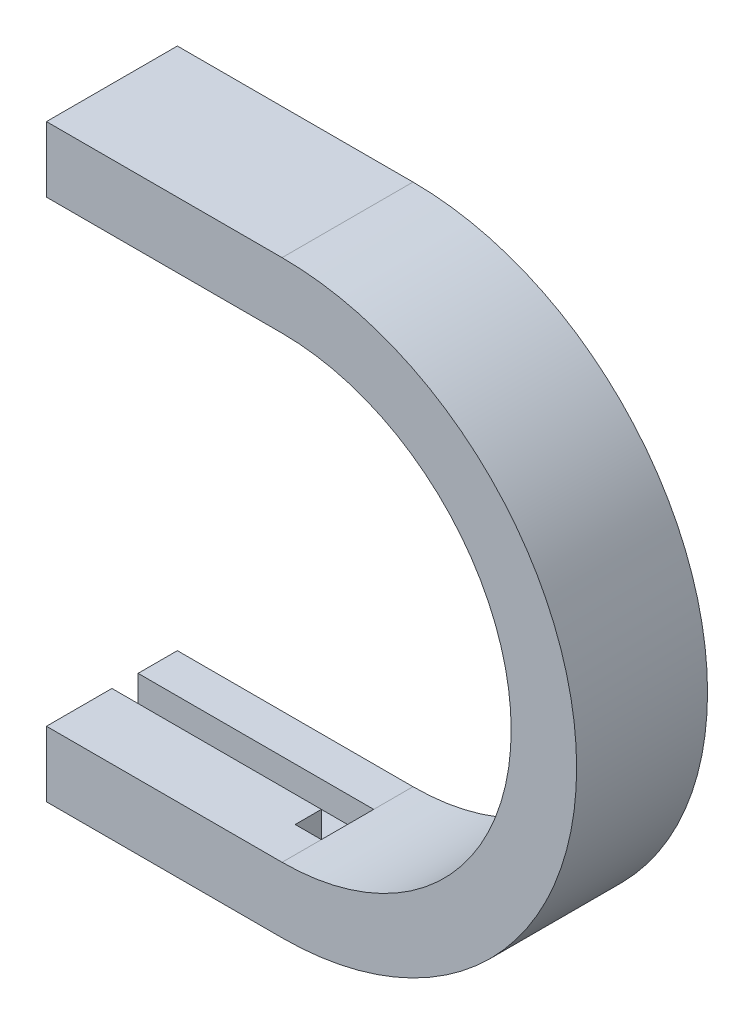
ISO-10303-21;
HEADER;
FILE_DESCRIPTION(('STEP AP214'),'2;1');
FILE_NAME('part.step','',(''),(''),'','','');
FILE_SCHEMA(('AUTOMOTIVE_DESIGN { 1 0 10303 214 1 1 1 1 }'));
ENDSEC;
DATA;
#1=APPLICATION_CONTEXT('core data for automotive mechanical design processes');
#2=APPLICATION_PROTOCOL_DEFINITION('international standard','automotive_design',2000,#1);
#3=PRODUCT_CONTEXT('',#1,'mechanical');
#4=PRODUCT('Part','Part','',(#3));
#5=PRODUCT_RELATED_PRODUCT_CATEGORY('part','',(#4));
#6=PRODUCT_DEFINITION_FORMATION('','',#4);
#7=PRODUCT_DEFINITION_CONTEXT('part definition',#1,'design');
#8=PRODUCT_DEFINITION('design','',#6,#7);
#9=PRODUCT_DEFINITION_SHAPE('','',#8);
#10=(LENGTH_UNIT() NAMED_UNIT(*) SI_UNIT(.MILLI.,.METRE.));
#11=(NAMED_UNIT(*) PLANE_ANGLE_UNIT() SI_UNIT($,.RADIAN.));
#12=(NAMED_UNIT(*) SI_UNIT($,.STERADIAN.) SOLID_ANGLE_UNIT());
#13=UNCERTAINTY_MEASURE_WITH_UNIT(LENGTH_MEASURE(1.E-05),#10,'distance_accuracy_value','');
#14=(GEOMETRIC_REPRESENTATION_CONTEXT(3) GLOBAL_UNCERTAINTY_ASSIGNED_CONTEXT((#13)) GLOBAL_UNIT_ASSIGNED_CONTEXT((#10,
#11,#12)) REPRESENTATION_CONTEXT('',''));
#15=CARTESIAN_POINT('',(0.,0.,0.));
#16=DIRECTION('',(0.,0.,1.));
#17=DIRECTION('',(1.,0.,0.));
#18=AXIS2_PLACEMENT_3D('',#15,#16,#17);
#19=CARTESIAN_POINT('',(-22.5,-1.25,-75.));
#20=DIRECTION('',(0.,-1.,0.));
#21=DIRECTION('',(-1.,0.,0.));
#22=AXIS2_PLACEMENT_3D('',#19,#20,#21);
#23=PLANE('',#22);
#24=DIRECTION('',(-1.,0.,0.));
#25=VECTOR('',#24,1.);
#26=CARTESIAN_POINT('',(-22.5,-1.25,-78.));
#27=LINE('',#26,#25);
#28=CARTESIAN_POINT('',(-22.5,-1.25,-78.));
#29=VERTEX_POINT('',#28);
#30=CARTESIAN_POINT('',(-24.5,-1.25,-78.));
#31=VERTEX_POINT('',#30);
#32=EDGE_CURVE('E11',#29,#31,#27,.T.);
#33=ORIENTED_EDGE('',*,*,#32,.T.);
#34=DIRECTION('',(0.,0.,-1.));
#35=VECTOR('',#34,1.);
#36=CARTESIAN_POINT('',(-24.5,-1.25,-78.));
#37=LINE('',#36,#35);
#38=CARTESIAN_POINT('',(-24.5,-1.25,-80.));
#39=VERTEX_POINT('',#38);
#40=EDGE_CURVE('E59',#31,#39,#37,.T.);
#41=ORIENTED_EDGE('',*,*,#40,.T.);
#42=DIRECTION('',(-1.,0.,0.));
#43=VECTOR('',#42,1.);
#44=CARTESIAN_POINT('',(-24.5,-1.25,-80.));
#45=LINE('',#44,#43);
#46=CARTESIAN_POINT('',(-40.5,-1.24999999999999,-80.));
#47=VERTEX_POINT('',#46);
#48=EDGE_CURVE('E251',#39,#47,#45,.T.);
#49=ORIENTED_EDGE('',*,*,#48,.T.);
#50=DIRECTION('',(0.,0.,-1.));
#51=VECTOR('',#50,1.);
#52=CARTESIAN_POINT('',(-40.5,-1.25,-75.));
#53=LINE('',#52,#51);
#54=CARTESIAN_POINT('',(-40.5,-1.25,-75.));
#55=VERTEX_POINT('',#54);
#56=EDGE_CURVE('E283',#55,#47,#53,.T.);
#57=ORIENTED_EDGE('',*,*,#56,.F.);
#58=DIRECTION('',(-1.,0.,0.));
#59=VECTOR('',#58,1.);
#60=CARTESIAN_POINT('',(-22.5,-1.25,-75.));
#61=LINE('',#60,#59);
#62=CARTESIAN_POINT('',(-22.5,-1.25,-75.));
#63=VERTEX_POINT('',#62);
#64=EDGE_CURVE('E278',#63,#55,#61,.T.);
#65=ORIENTED_EDGE('',*,*,#64,.F.);
#66=DIRECTION('',(0.,0.,-1.));
#67=VECTOR('',#66,1.);
#68=CARTESIAN_POINT('',(-22.5,-1.25,-75.));
#69=LINE('',#68,#67);
#70=EDGE_CURVE('E254',#63,#29,#69,.T.);
#71=ORIENTED_EDGE('',*,*,#70,.T.);
#72=EDGE_LOOP('',(#33,#41,#49,#57,#65,#71));
#73=FACE_BOUND('',#72,.T.);
#74=ADVANCED_FACE('F48',(#73),#23,.F.);
#75=CARTESIAN_POINT('',(-22.5,-1.25,-75.));
#76=DIRECTION('',(0.,-1.,0.));
#77=DIRECTION('',(-1.,0.,0.));
#78=AXIS2_PLACEMENT_3D('',#75,#76,#77);
#79=PLANE('',#78);
#80=DIRECTION('',(1.,0.,0.));
#81=VECTOR('',#80,1.);
#82=CARTESIAN_POINT('',(-22.5,-1.25,-82.));
#83=LINE('',#82,#81);
#84=CARTESIAN_POINT('',(-40.5,-1.24999999999999,-82.));
#85=VERTEX_POINT('',#84);
#86=CARTESIAN_POINT('',(-22.5,-1.25,-82.));
#87=VERTEX_POINT('',#86);
#88=EDGE_CURVE('E269',#85,#87,#83,.T.);
#89=ORIENTED_EDGE('',*,*,#88,.T.);
#90=DIRECTION('',(0.,0.,-1.));
#91=VECTOR('',#90,1.);
#92=CARTESIAN_POINT('',(-22.5,-1.25,-75.));
#93=LINE('',#92,#91);
#94=CARTESIAN_POINT('',(-22.5,-1.25,-85.));
#95=VERTEX_POINT('',#94);
#96=EDGE_CURVE('E231',#87,#95,#93,.T.);
#97=ORIENTED_EDGE('',*,*,#96,.T.);
#98=DIRECTION('',(-1.,0.,0.));
#99=VECTOR('',#98,1.);
#100=CARTESIAN_POINT('',(-22.5,-1.25,-85.));
#101=LINE('',#100,#99);
#102=CARTESIAN_POINT('',(-40.5,-1.25,-85.));
#103=VERTEX_POINT('',#102);
#104=EDGE_CURVE('E249',#95,#103,#101,.T.);
#105=ORIENTED_EDGE('',*,*,#104,.T.);
#106=DIRECTION('',(0.,0.,-1.));
#107=VECTOR('',#106,1.);
#108=CARTESIAN_POINT('',(-40.5,-1.25,-75.));
#109=LINE('',#108,#107);
#110=EDGE_CURVE('E259',#85,#103,#109,.T.);
#111=ORIENTED_EDGE('',*,*,#110,.F.);
#112=EDGE_LOOP('',(#89,#97,#105,#111));
#113=FACE_BOUND('',#112,.T.);
#114=ADVANCED_FACE('F505',(#113),#79,.F.);
#115=CARTESIAN_POINT('',(-40.5,-1.25,-75.));
#116=DIRECTION('',(1.,0.,0.));
#117=DIRECTION('',(0.,1.,0.));
#118=AXIS2_PLACEMENT_3D('',#115,#116,#117);
#119=PLANE('',#118);
#120=DIRECTION('',(0.,1.,0.));
#121=VECTOR('',#120,1.);
#122=CARTESIAN_POINT('',(-40.5,-3.25,-80.));
#123=LINE('',#122,#121);
#124=CARTESIAN_POINT('',(-40.5,-3.25,-80.));
#125=VERTEX_POINT('',#124);
#126=EDGE_CURVE('E239',#125,#47,#123,.T.);
#127=ORIENTED_EDGE('',*,*,#126,.F.);
#128=DIRECTION('',(0.,0.,-1.));
#129=VECTOR('',#128,1.);
#130=CARTESIAN_POINT('',(-40.5,-3.25,-82.));
#131=LINE('',#130,#129);
#132=CARTESIAN_POINT('',(-40.5,-3.25,-82.));
#133=VERTEX_POINT('',#132);
#134=EDGE_CURVE('E245',#125,#133,#131,.T.);
#135=ORIENTED_EDGE('',*,*,#134,.T.);
#136=DIRECTION('',(0.,1.,0.));
#137=VECTOR('',#136,1.);
#138=CARTESIAN_POINT('',(-40.5,-3.25,-82.));
#139=LINE('',#138,#137);
#140=EDGE_CURVE('E250',#133,#85,#139,.T.);
#141=ORIENTED_EDGE('',*,*,#140,.T.);
#142=ORIENTED_EDGE('',*,*,#110,.T.);
#143=DIRECTION('',(0.,-1.,0.));
#144=VECTOR('',#143,1.);
#145=CARTESIAN_POINT('',(-40.5,-1.25,-85.));
#146=LINE('',#145,#144);
#147=CARTESIAN_POINT('',(-40.5,-6.25,-85.));
#148=VERTEX_POINT('',#147);
#149=EDGE_CURVE('E279',#103,#148,#146,.T.);
#150=ORIENTED_EDGE('',*,*,#149,.T.);
#151=DIRECTION('',(0.,0.,-1.));
#152=VECTOR('',#151,1.);
#153=CARTESIAN_POINT('',(-40.5,-6.25,-75.));
#154=LINE('',#153,#152);
#155=CARTESIAN_POINT('',(-40.5,-6.25,-75.));
#156=VERTEX_POINT('',#155);
#157=EDGE_CURVE('E52',#156,#148,#154,.T.);
#158=ORIENTED_EDGE('',*,*,#157,.F.);
#159=DIRECTION('',(0.,-1.,0.));
#160=VECTOR('',#159,1.);
#161=CARTESIAN_POINT('',(-40.5,-1.25,-75.));
#162=LINE('',#161,#160);
#163=EDGE_CURVE('E301',#55,#156,#162,.T.);
#164=ORIENTED_EDGE('',*,*,#163,.F.);
#165=ORIENTED_EDGE('',*,*,#56,.T.);
#166=EDGE_LOOP('',(#127,#135,#141,#142,#150,#158,#164,#165));
#167=FACE_BOUND('',#166,.T.);
#168=ADVANCED_FACE('F551',(#167),#119,.F.);
#169=CARTESIAN_POINT('',(-40.5,33.75,-75.));
#170=DIRECTION('',(0.,1.,0.));
#171=DIRECTION('',(1.,0.,0.));
#172=AXIS2_PLACEMENT_3D('',#169,#170,#171);
#173=PLANE('',#172);
#174=DIRECTION('',(0.,0.,-1.));
#175=VECTOR('',#174,1.);
#176=CARTESIAN_POINT('',(-22.5,33.75,-75.));
#177=LINE('',#176,#175);
#178=CARTESIAN_POINT('',(-22.5,33.75,-82.));
#179=VERTEX_POINT('',#178);
#180=CARTESIAN_POINT('',(-22.5,33.75,-85.));
#181=VERTEX_POINT('',#180);
#182=EDGE_CURVE('E386',#179,#181,#177,.T.);
#183=ORIENTED_EDGE('',*,*,#182,.F.);
#184=DIRECTION('',(1.,0.,0.));
#185=VECTOR('',#184,1.);
#186=CARTESIAN_POINT('',(-22.5,33.75,-82.));
#187=LINE('',#186,#185);
#188=CARTESIAN_POINT('',(-40.5,33.75,-82.));
#189=VERTEX_POINT('',#188);
#190=EDGE_CURVE('E288',#189,#179,#187,.T.);
#191=ORIENTED_EDGE('',*,*,#190,.F.);
#192=DIRECTION('',(0.,0.,-1.));
#193=VECTOR('',#192,1.);
#194=CARTESIAN_POINT('',(-40.5,33.75,-75.));
#195=LINE('',#194,#193);
#196=CARTESIAN_POINT('',(-40.5,33.75,-85.));
#197=VERTEX_POINT('',#196);
#198=EDGE_CURVE('E300',#189,#197,#195,.T.);
#199=ORIENTED_EDGE('',*,*,#198,.T.);
#200=DIRECTION('',(1.,0.,0.));
#201=VECTOR('',#200,1.);
#202=CARTESIAN_POINT('',(-40.5,33.75,-85.));
#203=LINE('',#202,#201);
#204=EDGE_CURVE('E237',#197,#181,#203,.T.);
#205=ORIENTED_EDGE('',*,*,#204,.T.);
#206=EDGE_LOOP('',(#183,#191,#199,#205));
#207=FACE_BOUND('',#206,.T.);
#208=ADVANCED_FACE('F466',(#207),#173,.F.);
#209=CARTESIAN_POINT('',(-22.5,16.25,-75.));
#210=DIRECTION('',(0.,0.,-1.));
#211=DIRECTION('',(-1.,0.,0.));
#212=AXIS2_PLACEMENT_3D('',#209,#210,#211);
#213=CYLINDRICAL_SURFACE('',#212,22.5);
#214=CARTESIAN_POINT('',(-22.5,16.25,-85.));
#215=DIRECTION('',(0.,0.,1.));
#216=DIRECTION('',(1.,0.,0.));
#217=AXIS2_PLACEMENT_3D('',#214,#215,#216);
#218=CIRCLE('',#217,22.5);
#219=CARTESIAN_POINT('',(-22.5,-6.25,-85.));
#220=VERTEX_POINT('',#219);
#221=CARTESIAN_POINT('',(-22.5,38.75,-85.));
#222=VERTEX_POINT('',#221);
#223=EDGE_CURVE('E233',#220,#222,#218,.T.);
#224=ORIENTED_EDGE('',*,*,#223,.T.);
#225=DIRECTION('',(0.,0.,-1.));
#226=VECTOR('',#225,1.);
#227=CARTESIAN_POINT('',(-22.5,38.75,-75.));
#228=LINE('',#227,#226);
#229=CARTESIAN_POINT('',(-22.5,38.75,-75.));
#230=VERTEX_POINT('',#229);
#231=EDGE_CURVE('E293',#230,#222,#228,.T.);
#232=ORIENTED_EDGE('',*,*,#231,.F.);
#233=CARTESIAN_POINT('',(-22.5,16.25,-75.));
#234=DIRECTION('',(0.,0.,1.));
#235=DIRECTION('',(1.,0.,0.));
#236=AXIS2_PLACEMENT_3D('',#233,#234,#235);
#237=CIRCLE('',#236,22.5);
#238=CARTESIAN_POINT('',(-22.5,-6.25,-75.));
#239=VERTEX_POINT('',#238);
#240=EDGE_CURVE('E338',#239,#230,#237,.T.);
#241=ORIENTED_EDGE('',*,*,#240,.F.);
#242=DIRECTION('',(0.,0.,-1.));
#243=VECTOR('',#242,1.);
#244=CARTESIAN_POINT('',(-22.5,-6.25,-75.));
#245=LINE('',#244,#243);
#246=EDGE_CURVE('E238',#239,#220,#245,.T.);
#247=ORIENTED_EDGE('',*,*,#246,.T.);
#248=EDGE_LOOP('',(#224,#232,#241,#247));
#249=FACE_BOUND('',#248,.T.);
#250=ADVANCED_FACE('F556',(#249),#213,.T.);
#251=CARTESIAN_POINT('',(-22.5,38.75,-75.));
#252=DIRECTION('',(0.,-1.,0.));
#253=DIRECTION('',(0.,0.,-1.));
#254=AXIS2_PLACEMENT_3D('',#251,#252,#253);
#255=PLANE('',#254);
#256=DIRECTION('',(-1.,0.,0.));
#257=VECTOR('',#256,1.);
#258=CARTESIAN_POINT('',(-22.5,38.75,-85.));
#259=LINE('',#258,#257);
#260=CARTESIAN_POINT('',(-40.5,38.75,-85.));
#261=VERTEX_POINT('',#260);
#262=EDGE_CURVE('E272',#222,#261,#259,.T.);
#263=ORIENTED_EDGE('',*,*,#262,.T.);
#264=DIRECTION('',(0.,0.,-1.));
#265=VECTOR('',#264,1.);
#266=CARTESIAN_POINT('',(-40.5,38.75,-75.));
#267=LINE('',#266,#265);
#268=CARTESIAN_POINT('',(-40.5,38.75,-75.));
#269=VERTEX_POINT('',#268);
#270=EDGE_CURVE('E360',#269,#261,#267,.T.);
#271=ORIENTED_EDGE('',*,*,#270,.F.);
#272=DIRECTION('',(-1.,0.,0.));
#273=VECTOR('',#272,1.);
#274=CARTESIAN_POINT('',(-22.5,38.75,-75.));
#275=LINE('',#274,#273);
#276=EDGE_CURVE('E342',#230,#269,#275,.T.);
#277=ORIENTED_EDGE('',*,*,#276,.F.);
#278=ORIENTED_EDGE('',*,*,#231,.T.);
#279=EDGE_LOOP('',(#263,#271,#277,#278));
#280=FACE_BOUND('',#279,.T.);
#281=ADVANCED_FACE('F452',(#280),#255,.F.);
#282=CARTESIAN_POINT('',(-40.5,38.75,-75.));
#283=DIRECTION('',(1.,0.,0.));
#284=DIRECTION('',(0.,1.,0.));
#285=AXIS2_PLACEMENT_3D('',#282,#283,#284);
#286=PLANE('',#285);
#287=ORIENTED_EDGE('',*,*,#198,.F.);
#288=DIRECTION('',(0.,-1.,0.));
#289=VECTOR('',#288,1.);
#290=CARTESIAN_POINT('',(-40.5,35.75,-82.));
#291=LINE('',#290,#289);
#292=CARTESIAN_POINT('',(-40.5,35.75,-82.));
#293=VERTEX_POINT('',#292);
#294=EDGE_CURVE('E292',#293,#189,#291,.T.);
#295=ORIENTED_EDGE('',*,*,#294,.F.);
#296=DIRECTION('',(0.,0.,-1.));
#297=VECTOR('',#296,1.);
#298=CARTESIAN_POINT('',(-40.5,35.75,-82.));
#299=LINE('',#298,#297);
#300=CARTESIAN_POINT('',(-40.5,35.75,-80.));
#301=VERTEX_POINT('',#300);
#302=EDGE_CURVE('E205',#301,#293,#299,.T.);
#303=ORIENTED_EDGE('',*,*,#302,.F.);
#304=DIRECTION('',(0.,-1.,0.));
#305=VECTOR('',#304,1.);
#306=CARTESIAN_POINT('',(-40.5,35.75,-80.));
#307=LINE('',#306,#305);
#308=CARTESIAN_POINT('',(-40.5,33.75,-80.));
#309=VERTEX_POINT('',#308);
#310=EDGE_CURVE('E200',#301,#309,#307,.T.);
#311=ORIENTED_EDGE('',*,*,#310,.T.);
#312=DIRECTION('',(0.,0.,-1.));
#313=VECTOR('',#312,1.);
#314=CARTESIAN_POINT('',(-40.5,33.75,-75.));
#315=LINE('',#314,#313);
#316=CARTESIAN_POINT('',(-40.5,33.75,-75.));
#317=VERTEX_POINT('',#316);
#318=EDGE_CURVE('E264',#317,#309,#315,.T.);
#319=ORIENTED_EDGE('',*,*,#318,.F.);
#320=DIRECTION('',(0.,-1.,0.));
#321=VECTOR('',#320,1.);
#322=CARTESIAN_POINT('',(-40.5,38.75,-75.));
#323=LINE('',#322,#321);
#324=EDGE_CURVE('E345',#269,#317,#323,.T.);
#325=ORIENTED_EDGE('',*,*,#324,.F.);
#326=ORIENTED_EDGE('',*,*,#270,.T.);
#327=DIRECTION('',(0.,-1.,0.));
#328=VECTOR('',#327,1.);
#329=CARTESIAN_POINT('',(-40.5,38.75,-85.));
#330=LINE('',#329,#328);
#331=EDGE_CURVE('E306',#261,#197,#330,.T.);
#332=ORIENTED_EDGE('',*,*,#331,.T.);
#333=EDGE_LOOP('',(#287,#295,#303,#311,#319,#325,#326,#332));
#334=FACE_BOUND('',#333,.T.);
#335=ADVANCED_FACE('F446',(#334),#286,.F.);
#336=CARTESIAN_POINT('',(-40.5,33.75,-75.));
#337=DIRECTION('',(0.,1.,0.));
#338=DIRECTION('',(1.,0.,0.));
#339=AXIS2_PLACEMENT_3D('',#336,#337,#338);
#340=PLANE('',#339);
#341=ORIENTED_EDGE('',*,*,#318,.T.);
#342=DIRECTION('',(-1.,0.,0.));
#343=VECTOR('',#342,1.);
#344=CARTESIAN_POINT('',(-24.5,33.75,-80.));
#345=LINE('',#344,#343);
#346=CARTESIAN_POINT('',(-24.5,33.75,-80.));
#347=VERTEX_POINT('',#346);
#348=EDGE_CURVE('E215',#347,#309,#345,.T.);
#349=ORIENTED_EDGE('',*,*,#348,.F.);
#350=DIRECTION('',(0.,0.,-1.));
#351=VECTOR('',#350,1.);
#352=CARTESIAN_POINT('',(-24.5,33.75,-78.));
#353=LINE('',#352,#351);
#354=CARTESIAN_POINT('',(-24.5,33.75,-78.));
#355=VERTEX_POINT('',#354);
#356=EDGE_CURVE('E212',#355,#347,#353,.T.);
#357=ORIENTED_EDGE('',*,*,#356,.F.);
#358=DIRECTION('',(-1.,0.,0.));
#359=VECTOR('',#358,1.);
#360=CARTESIAN_POINT('',(-22.5,33.75,-78.));
#361=LINE('',#360,#359);
#362=CARTESIAN_POINT('',(-22.5,33.75,-78.));
#363=VERTEX_POINT('',#362);
#364=EDGE_CURVE('E336',#363,#355,#361,.T.);
#365=ORIENTED_EDGE('',*,*,#364,.F.);
#366=DIRECTION('',(0.,0.,-1.));
#367=VECTOR('',#366,1.);
#368=CARTESIAN_POINT('',(-22.5,33.75,-75.));
#369=LINE('',#368,#367);
#370=CARTESIAN_POINT('',(-22.5,33.75,-75.));
#371=VERTEX_POINT('',#370);
#372=EDGE_CURVE('E355',#371,#363,#369,.T.);
#373=ORIENTED_EDGE('',*,*,#372,.F.);
#374=DIRECTION('',(1.,0.,0.));
#375=VECTOR('',#374,1.);
#376=CARTESIAN_POINT('',(-40.5,33.75,-75.));
#377=LINE('',#376,#375);
#378=EDGE_CURVE('E277',#317,#371,#377,.T.);
#379=ORIENTED_EDGE('',*,*,#378,.F.);
#380=EDGE_LOOP('',(#341,#349,#357,#365,#373,#379));
#381=FACE_BOUND('',#380,.T.);
#382=ADVANCED_FACE('F475',(#381),#340,.F.);
#383=CARTESIAN_POINT('',(-22.5,16.25,-75.));
#384=DIRECTION('',(0.,0.,-1.));
#385=DIRECTION('',(-1.,0.,0.));
#386=AXIS2_PLACEMENT_3D('',#383,#384,#385);
#387=CYLINDRICAL_SURFACE('',#386,17.5);
#388=CARTESIAN_POINT('',(-22.5,16.25,-85.));
#389=DIRECTION('',(0.,0.,-1.));
#390=DIRECTION('',(1.,0.,0.));
#391=AXIS2_PLACEMENT_3D('',#388,#389,#390);
#392=CIRCLE('',#391,17.5);
#393=EDGE_CURVE('E260',#181,#95,#392,.T.);
#394=ORIENTED_EDGE('',*,*,#393,.T.);
#395=ORIENTED_EDGE('',*,*,#96,.F.);
#396=DIRECTION('',(0.,0.,1.));
#397=VECTOR('',#396,1.);
#398=CARTESIAN_POINT('',(-22.5,-1.25,-82.));
#399=LINE('',#398,#397);
#400=EDGE_CURVE('E265',#87,#29,#399,.T.);
#401=ORIENTED_EDGE('',*,*,#400,.T.);
#402=ORIENTED_EDGE('',*,*,#70,.F.);
#403=CARTESIAN_POINT('',(-22.5,16.25,-75.));
#404=DIRECTION('',(0.,0.,-1.));
#405=DIRECTION('',(1.,0.,0.));
#406=AXIS2_PLACEMENT_3D('',#403,#404,#405);
#407=CIRCLE('',#406,17.5);
#408=EDGE_CURVE('E273',#371,#63,#407,.T.);
#409=ORIENTED_EDGE('',*,*,#408,.F.);
#410=ORIENTED_EDGE('',*,*,#372,.T.);
#411=DIRECTION('',(0.,0.,1.));
#412=VECTOR('',#411,1.);
#413=CARTESIAN_POINT('',(-22.5,33.75,-82.));
#414=LINE('',#413,#412);
#415=EDGE_CURVE('E363',#179,#363,#414,.T.);
#416=ORIENTED_EDGE('',*,*,#415,.F.);
#417=ORIENTED_EDGE('',*,*,#182,.T.);
#418=EDGE_LOOP('',(#394,#395,#401,#402,#409,#410,#416,#417));
#419=FACE_BOUND('',#418,.T.);
#420=ADVANCED_FACE('F501',(#419),#387,.F.);
#421=CARTESIAN_POINT('',(-40.5,-6.25,-75.));
#422=DIRECTION('',(0.,1.,0.));
#423=DIRECTION('',(1.,0.,0.));
#424=AXIS2_PLACEMENT_3D('',#421,#422,#423);
#425=PLANE('',#424);
#426=DIRECTION('',(1.,0.,0.));
#427=VECTOR('',#426,1.);
#428=CARTESIAN_POINT('',(-40.5,-6.25,-85.));
#429=LINE('',#428,#427);
#430=EDGE_CURVE('E389',#148,#220,#429,.T.);
#431=ORIENTED_EDGE('',*,*,#430,.T.);
#432=ORIENTED_EDGE('',*,*,#246,.F.);
#433=DIRECTION('',(1.,0.,0.));
#434=VECTOR('',#433,1.);
#435=CARTESIAN_POINT('',(-40.5,-6.25,-75.));
#436=LINE('',#435,#434);
#437=EDGE_CURVE('E304',#156,#239,#436,.T.);
#438=ORIENTED_EDGE('',*,*,#437,.F.);
#439=ORIENTED_EDGE('',*,*,#157,.T.);
#440=EDGE_LOOP('',(#431,#432,#438,#439));
#441=FACE_BOUND('',#440,.T.);
#442=ADVANCED_FACE('F567',(#441),#425,.F.);
#443=CARTESIAN_POINT('',(-22.5,16.25,-75.));
#444=DIRECTION('',(0.,0.,1.));
#445=DIRECTION('',(1.,0.,0.));
#446=AXIS2_PLACEMENT_3D('',#443,#444,#445);
#447=PLANE('',#446);
#448=ORIENTED_EDGE('',*,*,#240,.T.);
#449=ORIENTED_EDGE('',*,*,#276,.T.);
#450=ORIENTED_EDGE('',*,*,#324,.T.);
#451=ORIENTED_EDGE('',*,*,#378,.T.);
#452=ORIENTED_EDGE('',*,*,#408,.T.);
#453=ORIENTED_EDGE('',*,*,#64,.T.);
#454=ORIENTED_EDGE('',*,*,#163,.T.);
#455=ORIENTED_EDGE('',*,*,#437,.T.);
#456=EDGE_LOOP('',(#448,#449,#450,#451,#452,#453,#454,#455));
#457=FACE_BOUND('',#456,.T.);
#458=ADVANCED_FACE('F482',(#457),#447,.T.);
#459=CARTESIAN_POINT('',(-22.5,16.25,-85.));
#460=DIRECTION('',(0.,0.,1.));
#461=DIRECTION('',(1.,0.,0.));
#462=AXIS2_PLACEMENT_3D('',#459,#460,#461);
#463=PLANE('',#462);
#464=ORIENTED_EDGE('',*,*,#223,.F.);
#465=ORIENTED_EDGE('',*,*,#430,.F.);
#466=ORIENTED_EDGE('',*,*,#149,.F.);
#467=ORIENTED_EDGE('',*,*,#104,.F.);
#468=ORIENTED_EDGE('',*,*,#393,.F.);
#469=ORIENTED_EDGE('',*,*,#204,.F.);
#470=ORIENTED_EDGE('',*,*,#331,.F.);
#471=ORIENTED_EDGE('',*,*,#262,.F.);
#472=EDGE_LOOP('',(#464,#465,#466,#467,#468,#469,#470,#471));
#473=FACE_BOUND('',#472,.T.);
#474=ADVANCED_FACE('F457',(#473),#463,.F.);
#475=CARTESIAN_POINT('',(-22.5,35.75,-82.));
#476=DIRECTION('',(1.,0.,0.));
#477=DIRECTION('',(0.,1.,0.));
#478=AXIS2_PLACEMENT_3D('',#475,#476,#477);
#479=PLANE('',#478);
#480=ORIENTED_EDGE('',*,*,#415,.T.);
#481=DIRECTION('',(0.,-1.,0.));
#482=VECTOR('',#481,1.);
#483=CARTESIAN_POINT('',(-22.5,35.75,-78.));
#484=LINE('',#483,#482);
#485=CARTESIAN_POINT('',(-22.5,35.75,-78.));
#486=VERTEX_POINT('',#485);
#487=EDGE_CURVE('E404',#486,#363,#484,.T.);
#488=ORIENTED_EDGE('',*,*,#487,.F.);
#489=DIRECTION('',(0.,0.,1.));
#490=VECTOR('',#489,1.);
#491=CARTESIAN_POINT('',(-22.5,35.75,-82.));
#492=LINE('',#491,#490);
#493=CARTESIAN_POINT('',(-22.5,35.75,-82.));
#494=VERTEX_POINT('',#493);
#495=EDGE_CURVE('E227',#494,#486,#492,.T.);
#496=ORIENTED_EDGE('',*,*,#495,.F.);
#497=DIRECTION('',(0.,-1.,0.));
#498=VECTOR('',#497,1.);
#499=CARTESIAN_POINT('',(-22.5,35.75,-82.));
#500=LINE('',#499,#498);
#501=EDGE_CURVE('E291',#494,#179,#500,.T.);
#502=ORIENTED_EDGE('',*,*,#501,.T.);
#503=EDGE_LOOP('',(#480,#488,#496,#502));
#504=FACE_BOUND('',#503,.T.);
#505=ADVANCED_FACE('F533',(#504),#479,.F.);
#506=CARTESIAN_POINT('',(-22.5,35.75,-82.));
#507=DIRECTION('',(0.,0.,-1.));
#508=DIRECTION('',(0.,-1.,0.));
#509=AXIS2_PLACEMENT_3D('',#506,#507,#508);
#510=PLANE('',#509);
#511=ORIENTED_EDGE('',*,*,#190,.T.);
#512=ORIENTED_EDGE('',*,*,#501,.F.);
#513=DIRECTION('',(1.,0.,0.));
#514=VECTOR('',#513,1.);
#515=CARTESIAN_POINT('',(-22.5,35.75,-82.));
#516=LINE('',#515,#514);
#517=EDGE_CURVE('E310',#293,#494,#516,.T.);
#518=ORIENTED_EDGE('',*,*,#517,.F.);
#519=ORIENTED_EDGE('',*,*,#294,.T.);
#520=EDGE_LOOP('',(#511,#512,#518,#519));
#521=FACE_BOUND('',#520,.T.);
#522=ADVANCED_FACE('F472',(#521),#510,.F.);
#523=CARTESIAN_POINT('',(-24.5,35.75,-80.));
#524=DIRECTION('',(0.,0.,1.));
#525=DIRECTION('',(1.,0.,0.));
#526=AXIS2_PLACEMENT_3D('',#523,#524,#525);
#527=PLANE('',#526);
#528=ORIENTED_EDGE('',*,*,#348,.T.);
#529=ORIENTED_EDGE('',*,*,#310,.F.);
#530=DIRECTION('',(-1.,0.,0.));
#531=VECTOR('',#530,1.);
#532=CARTESIAN_POINT('',(-24.5,35.75,-80.));
#533=LINE('',#532,#531);
#534=CARTESIAN_POINT('',(-24.5,35.75,-80.));
#535=VERTEX_POINT('',#534);
#536=EDGE_CURVE('E194',#535,#301,#533,.T.);
#537=ORIENTED_EDGE('',*,*,#536,.F.);
#538=DIRECTION('',(0.,-1.,0.));
#539=VECTOR('',#538,1.);
#540=CARTESIAN_POINT('',(-24.5,35.75,-80.));
#541=LINE('',#540,#539);
#542=EDGE_CURVE('E198',#535,#347,#541,.T.);
#543=ORIENTED_EDGE('',*,*,#542,.T.);
#544=EDGE_LOOP('',(#528,#529,#537,#543));
#545=FACE_BOUND('',#544,.T.);
#546=ADVANCED_FACE('F197',(#545),#527,.F.);
#547=CARTESIAN_POINT('',(-24.5,35.75,-78.));
#548=DIRECTION('',(-1.,0.,0.));
#549=DIRECTION('',(0.,1.,0.));
#550=AXIS2_PLACEMENT_3D('',#547,#548,#549);
#551=PLANE('',#550);
#552=ORIENTED_EDGE('',*,*,#356,.T.);
#553=ORIENTED_EDGE('',*,*,#542,.F.);
#554=DIRECTION('',(0.,0.,-1.));
#555=VECTOR('',#554,1.);
#556=CARTESIAN_POINT('',(-24.5,35.75,-78.));
#557=LINE('',#556,#555);
#558=CARTESIAN_POINT('',(-24.5,35.75,-78.));
#559=VERTEX_POINT('',#558);
#560=EDGE_CURVE('E204',#559,#535,#557,.T.);
#561=ORIENTED_EDGE('',*,*,#560,.F.);
#562=DIRECTION('',(0.,-1.,0.));
#563=VECTOR('',#562,1.);
#564=CARTESIAN_POINT('',(-24.5,35.75,-78.));
#565=LINE('',#564,#563);
#566=EDGE_CURVE('E398',#559,#355,#565,.T.);
#567=ORIENTED_EDGE('',*,*,#566,.T.);
#568=EDGE_LOOP('',(#552,#553,#561,#567));
#569=FACE_BOUND('',#568,.T.);
#570=ADVANCED_FACE('F208',(#569),#551,.F.);
#571=CARTESIAN_POINT('',(-22.5,35.75,-78.));
#572=DIRECTION('',(0.,0.,1.));
#573=DIRECTION('',(1.,0.,0.));
#574=AXIS2_PLACEMENT_3D('',#571,#572,#573);
#575=PLANE('',#574);
#576=ORIENTED_EDGE('',*,*,#364,.T.);
#577=ORIENTED_EDGE('',*,*,#566,.F.);
#578=DIRECTION('',(-1.,0.,0.));
#579=VECTOR('',#578,1.);
#580=CARTESIAN_POINT('',(-22.5,35.75,-78.));
#581=LINE('',#580,#579);
#582=EDGE_CURVE('E221',#486,#559,#581,.T.);
#583=ORIENTED_EDGE('',*,*,#582,.F.);
#584=ORIENTED_EDGE('',*,*,#487,.T.);
#585=EDGE_LOOP('',(#576,#577,#583,#584));
#586=FACE_BOUND('',#585,.T.);
#587=ADVANCED_FACE('F532',(#586),#575,.F.);
#588=CARTESIAN_POINT('',(0.,35.75,0.));
#589=DIRECTION('',(0.,-1.,0.));
#590=DIRECTION('',(0.,0.,-1.));
#591=AXIS2_PLACEMENT_3D('',#588,#589,#590);
#592=PLANE('',#591);
#593=ORIENTED_EDGE('',*,*,#495,.T.);
#594=ORIENTED_EDGE('',*,*,#582,.T.);
#595=ORIENTED_EDGE('',*,*,#560,.T.);
#596=ORIENTED_EDGE('',*,*,#536,.T.);
#597=ORIENTED_EDGE('',*,*,#302,.T.);
#598=ORIENTED_EDGE('',*,*,#517,.T.);
#599=EDGE_LOOP('',(#593,#594,#595,#596,#597,#598));
#600=FACE_BOUND('',#599,.T.);
#601=ADVANCED_FACE('F219',(#600),#592,.T.);
#602=CARTESIAN_POINT('',(-22.5,-3.25,-82.));
#603=DIRECTION('',(-1.,0.,0.));
#604=DIRECTION('',(0.,0.,1.));
#605=AXIS2_PLACEMENT_3D('',#602,#603,#604);
#606=PLANE('',#605);
#607=ORIENTED_EDGE('',*,*,#400,.F.);
#608=DIRECTION('',(0.,1.,0.));
#609=VECTOR('',#608,1.);
#610=CARTESIAN_POINT('',(-22.5,-3.25,-82.));
#611=LINE('',#610,#609);
#612=CARTESIAN_POINT('',(-22.5,-3.25,-82.));
#613=VERTEX_POINT('',#612);
#614=EDGE_CURVE('E346',#613,#87,#611,.T.);
#615=ORIENTED_EDGE('',*,*,#614,.F.);
#616=DIRECTION('',(0.,0.,1.));
#617=VECTOR('',#616,1.);
#618=CARTESIAN_POINT('',(-22.5,-3.25,-82.));
#619=LINE('',#618,#617);
#620=CARTESIAN_POINT('',(-22.5,-3.25,-78.));
#621=VERTEX_POINT('',#620);
#622=EDGE_CURVE('E307',#613,#621,#619,.T.);
#623=ORIENTED_EDGE('',*,*,#622,.T.);
#624=DIRECTION('',(0.,1.,0.));
#625=VECTOR('',#624,1.);
#626=CARTESIAN_POINT('',(-22.5,-3.25,-78.));
#627=LINE('',#626,#625);
#628=EDGE_CURVE('E311',#621,#29,#627,.T.);
#629=ORIENTED_EDGE('',*,*,#628,.T.);
#630=EDGE_LOOP('',(#607,#615,#623,#629));
#631=FACE_BOUND('',#630,.T.);
#632=ADVANCED_FACE('F497',(#631),#606,.T.);
#633=CARTESIAN_POINT('',(-22.5,-3.25,-78.));
#634=DIRECTION('',(0.,0.,-1.));
#635=DIRECTION('',(0.,-1.,0.));
#636=AXIS2_PLACEMENT_3D('',#633,#634,#635);
#637=PLANE('',#636);
#638=ORIENTED_EDGE('',*,*,#32,.F.);
#639=ORIENTED_EDGE('',*,*,#628,.F.);
#640=DIRECTION('',(-1.,0.,0.));
#641=VECTOR('',#640,1.);
#642=CARTESIAN_POINT('',(-22.5,-3.25,-78.));
#643=LINE('',#642,#641);
#644=CARTESIAN_POINT('',(-24.5,-3.25,-78.));
#645=VERTEX_POINT('',#644);
#646=EDGE_CURVE('E324',#621,#645,#643,.T.);
#647=ORIENTED_EDGE('',*,*,#646,.T.);
#648=DIRECTION('',(0.,1.,0.));
#649=VECTOR('',#648,1.);
#650=CARTESIAN_POINT('',(-24.5,-3.25,-78.));
#651=LINE('',#650,#649);
#652=EDGE_CURVE('E332',#645,#31,#651,.T.);
#653=ORIENTED_EDGE('',*,*,#652,.T.);
#654=EDGE_LOOP('',(#638,#639,#647,#653));
#655=FACE_BOUND('',#654,.T.);
#656=ADVANCED_FACE('F517',(#655),#637,.T.);
#657=CARTESIAN_POINT('',(-24.5,-3.25,-78.));
#658=DIRECTION('',(1.,0.,0.));
#659=DIRECTION('',(0.,1.,0.));
#660=AXIS2_PLACEMENT_3D('',#657,#658,#659);
#661=PLANE('',#660);
#662=ORIENTED_EDGE('',*,*,#40,.F.);
#663=ORIENTED_EDGE('',*,*,#652,.F.);
#664=DIRECTION('',(0.,0.,-1.));
#665=VECTOR('',#664,1.);
#666=CARTESIAN_POINT('',(-24.5,-3.25,-78.));
#667=LINE('',#666,#665);
#668=CARTESIAN_POINT('',(-24.5,-3.25,-80.));
#669=VERTEX_POINT('',#668);
#670=EDGE_CURVE('E287',#645,#669,#667,.T.);
#671=ORIENTED_EDGE('',*,*,#670,.T.);
#672=DIRECTION('',(0.,1.,0.));
#673=VECTOR('',#672,1.);
#674=CARTESIAN_POINT('',(-24.5,-3.25,-80.));
#675=LINE('',#674,#673);
#676=EDGE_CURVE('E284',#669,#39,#675,.T.);
#677=ORIENTED_EDGE('',*,*,#676,.T.);
#678=EDGE_LOOP('',(#662,#663,#671,#677));
#679=FACE_BOUND('',#678,.T.);
#680=ADVANCED_FACE('F572',(#679),#661,.T.);
#681=CARTESIAN_POINT('',(-24.5,-3.25,-80.));
#682=DIRECTION('',(0.,0.,-1.));
#683=DIRECTION('',(0.,-1.,0.));
#684=AXIS2_PLACEMENT_3D('',#681,#682,#683);
#685=PLANE('',#684);
#686=ORIENTED_EDGE('',*,*,#48,.F.);
#687=ORIENTED_EDGE('',*,*,#676,.F.);
#688=DIRECTION('',(-1.,0.,0.));
#689=VECTOR('',#688,1.);
#690=CARTESIAN_POINT('',(-24.5,-3.25,-80.));
#691=LINE('',#690,#689);
#692=EDGE_CURVE('E243',#669,#125,#691,.T.);
#693=ORIENTED_EDGE('',*,*,#692,.T.);
#694=ORIENTED_EDGE('',*,*,#126,.T.);
#695=EDGE_LOOP('',(#686,#687,#693,#694));
#696=FACE_BOUND('',#695,.T.);
#697=ADVANCED_FACE('F575',(#696),#685,.T.);
#698=CARTESIAN_POINT('',(-22.5,-3.25,-82.));
#699=DIRECTION('',(0.,0.,1.));
#700=DIRECTION('',(1.,0.,0.));
#701=AXIS2_PLACEMENT_3D('',#698,#699,#700);
#702=PLANE('',#701);
#703=ORIENTED_EDGE('',*,*,#88,.F.);
#704=ORIENTED_EDGE('',*,*,#140,.F.);
#705=DIRECTION('',(1.,0.,0.));
#706=VECTOR('',#705,1.);
#707=CARTESIAN_POINT('',(-22.5,-3.25,-82.));
#708=LINE('',#707,#706);
#709=EDGE_CURVE('E244',#133,#613,#708,.T.);
#710=ORIENTED_EDGE('',*,*,#709,.T.);
#711=ORIENTED_EDGE('',*,*,#614,.T.);
#712=EDGE_LOOP('',(#703,#704,#710,#711));
#713=FACE_BOUND('',#712,.T.);
#714=ADVANCED_FACE('F50',(#713),#702,.T.);
#715=CARTESIAN_POINT('',(0.,-3.25,0.));
#716=DIRECTION('',(0.,1.,0.));
#717=DIRECTION('',(1.,0.,0.));
#718=AXIS2_PLACEMENT_3D('',#715,#716,#717);
#719=PLANE('',#718);
#720=ORIENTED_EDGE('',*,*,#622,.F.);
#721=ORIENTED_EDGE('',*,*,#709,.F.);
#722=ORIENTED_EDGE('',*,*,#134,.F.);
#723=ORIENTED_EDGE('',*,*,#692,.F.);
#724=ORIENTED_EDGE('',*,*,#670,.F.);
#725=ORIENTED_EDGE('',*,*,#646,.F.);
#726=EDGE_LOOP('',(#720,#721,#722,#723,#724,#725));
#727=FACE_BOUND('',#726,.T.);
#728=ADVANCED_FACE('F510',(#727),#719,.T.);
#729=CLOSED_SHELL('',(#74,#114,#168,#208,#250,#281,#335,#382,#420,#442,#458,#474,#505,#522,#546,
#570,#587,#601,#632,#656,#680,#697,#714,#728));
#730=MANIFOLD_SOLID_BREP('B2',#729);
#731=ADVANCED_BREP_SHAPE_REPRESENTATION('',(#18,#730),#14);
#732=SHAPE_DEFINITION_REPRESENTATION(#9,#731);
ENDSEC;
END-ISO-10303-21;
